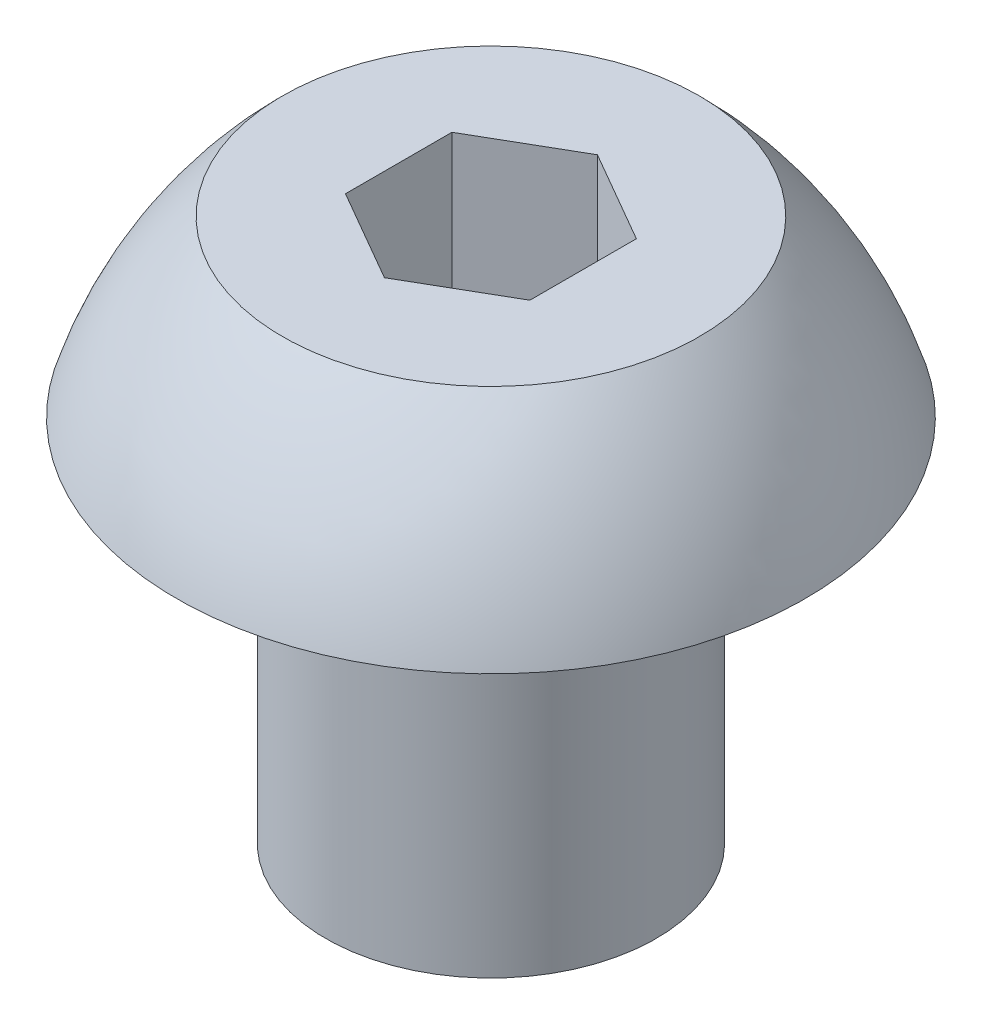
ISO-10303-21;
HEADER;
FILE_DESCRIPTION(('STEP AP214'),'2;1');
FILE_NAME('part.step','',(''),(''),'','','');
FILE_SCHEMA(('AUTOMOTIVE_DESIGN { 1 0 10303 214 1 1 1 1 }'));
ENDSEC;
DATA;
#1=APPLICATION_CONTEXT('core data for automotive mechanical design processes');
#2=APPLICATION_PROTOCOL_DEFINITION('international standard','automotive_design',2000,#1);
#3=PRODUCT_CONTEXT('',#1,'mechanical');
#4=PRODUCT('Part','Part','',(#3));
#5=PRODUCT_RELATED_PRODUCT_CATEGORY('part','',(#4));
#6=PRODUCT_DEFINITION_FORMATION('','',#4);
#7=PRODUCT_DEFINITION_CONTEXT('part definition',#1,'design');
#8=PRODUCT_DEFINITION('design','',#6,#7);
#9=PRODUCT_DEFINITION_SHAPE('','',#8);
#10=(LENGTH_UNIT() NAMED_UNIT(*) SI_UNIT(.MILLI.,.METRE.));
#11=(NAMED_UNIT(*) PLANE_ANGLE_UNIT() SI_UNIT($,.RADIAN.));
#12=(NAMED_UNIT(*) SI_UNIT($,.STERADIAN.) SOLID_ANGLE_UNIT());
#13=UNCERTAINTY_MEASURE_WITH_UNIT(LENGTH_MEASURE(1.E-05),#10,'distance_accuracy_value','');
#14=(GEOMETRIC_REPRESENTATION_CONTEXT(3) GLOBAL_UNCERTAINTY_ASSIGNED_CONTEXT((#13)) GLOBAL_UNIT_ASSIGNED_CONTEXT((#10,
#11,#12)) REPRESENTATION_CONTEXT('',''));
#15=CARTESIAN_POINT('',(0.,0.,0.));
#16=DIRECTION('',(0.,0.,1.));
#17=DIRECTION('',(1.,0.,0.));
#18=AXIS2_PLACEMENT_3D('',#15,#16,#17);
#19=CARTESIAN_POINT('',(0.,-3.175,0.));
#20=DIRECTION('',(0.,-1.,0.));
#21=DIRECTION('',(0.,0.,-1.));
#22=AXIS2_PLACEMENT_3D('',#19,#20,#21);
#23=CYLINDRICAL_SURFACE('',#22,1.4224);
#24=CARTESIAN_POINT('',(0.,-3.175,0.));
#25=DIRECTION('',(0.,-1.,0.));
#26=DIRECTION('',(0.,0.,-1.));
#27=AXIS2_PLACEMENT_3D('',#24,#25,#26);
#28=CIRCLE('',#27,1.4224);
#29=CARTESIAN_POINT('',(0.,-3.175,-1.4224));
#30=VERTEX_POINT('',#29);
#31=EDGE_CURVE('E134',#30,#30,#28,.T.);
#32=ORIENTED_EDGE('',*,*,#31,.F.);
#33=EDGE_LOOP('',(#32));
#34=FACE_BOUND('',#33,.T.);
#35=CARTESIAN_POINT('',(0.,0.,0.));
#36=DIRECTION('',(0.,-1.,0.));
#37=DIRECTION('',(0.,0.,-1.));
#38=AXIS2_PLACEMENT_3D('',#35,#36,#37);
#39=CIRCLE('',#38,1.4224);
#40=CARTESIAN_POINT('',(0.,0.,-1.4224));
#41=VERTEX_POINT('',#40);
#42=EDGE_CURVE('E11',#41,#41,#39,.T.);
#43=ORIENTED_EDGE('',*,*,#42,.T.);
#44=EDGE_LOOP('',(#43));
#45=FACE_BOUND('',#44,.T.);
#46=ADVANCED_FACE('F33',(#34,#45),#23,.T.);
#47=CARTESIAN_POINT('',(-1.4224,0.,0.));
#48=DIRECTION('',(0.,1.,0.));
#49=DIRECTION('',(0.,0.,1.));
#50=AXIS2_PLACEMENT_3D('',#47,#48,#49);
#51=PLANE('',#50);
#52=ORIENTED_EDGE('',*,*,#42,.F.);
#53=EDGE_LOOP('',(#52));
#54=FACE_BOUND('',#53,.T.);
#55=CARTESIAN_POINT('',(0.,0.,0.));
#56=DIRECTION('',(0.,-1.,0.));
#57=DIRECTION('',(0.,0.,-1.));
#58=AXIS2_PLACEMENT_3D('',#55,#56,#57);
#59=CIRCLE('',#58,2.7051);
#60=CARTESIAN_POINT('',(0.,0.,-2.7051));
#61=VERTEX_POINT('',#60);
#62=EDGE_CURVE('E40',#61,#61,#59,.T.);
#63=ORIENTED_EDGE('',*,*,#62,.T.);
#64=EDGE_LOOP('',(#63));
#65=FACE_BOUND('',#64,.T.);
#66=ADVANCED_FACE('F147',(#54,#65),#51,.F.);
#67=CARTESIAN_POINT('',(0.,-1.04271365415663,0.));
#68=DIRECTION('',(0.,-1.,0.));
#69=DIRECTION('',(0.,0.,-1.));
#70=AXIS2_PLACEMENT_3D('',#67,#68,#69);
#71=DEGENERATE_TOROIDAL_SURFACE('',#70,0.700107002516782,3.5612759643917,.F.);
#72=ORIENTED_EDGE('',*,*,#62,.F.);
#73=EDGE_LOOP('',(#72));
#74=FACE_BOUND('',#73,.T.);
#75=CARTESIAN_POINT('',(0.,1.4986,0.));
#76=DIRECTION('',(0.,-1.,0.));
#77=DIRECTION('',(0.,0.,-1.));
#78=AXIS2_PLACEMENT_3D('',#75,#76,#77);
#79=CIRCLE('',#78,1.7947700296736);
#80=CARTESIAN_POINT('',(0.,1.4986,-1.7947700296736));
#81=VERTEX_POINT('',#80);
#82=EDGE_CURVE('E142',#81,#81,#79,.T.);
#83=ORIENTED_EDGE('',*,*,#82,.T.);
#84=EDGE_LOOP('',(#83));
#85=FACE_BOUND('',#84,.T.);
#86=ADVANCED_FACE('F149',(#74,#85),#71,.F.);
#87=CARTESIAN_POINT('',(0.,1.4986,0.));
#88=DIRECTION('',(0.,-1.,0.));
#89=DIRECTION('',(0.,0.,-1.));
#90=AXIS2_PLACEMENT_3D('',#87,#88,#89);
#91=PLANE('',#90);
#92=DIRECTION('',(0.,0.,1.));
#93=VECTOR('',#92,1.);
#94=CARTESIAN_POINT('',(-0.79375,1.4986,-0.458271776169265));
#95=LINE('',#94,#93);
#96=CARTESIAN_POINT('',(-0.79375,1.4986,-0.458271776169265));
#97=VERTEX_POINT('',#96);
#98=CARTESIAN_POINT('',(-0.79375,1.4986,0.458271776169266));
#99=VERTEX_POINT('',#98);
#100=EDGE_CURVE('E121',#97,#99,#95,.T.);
#101=ORIENTED_EDGE('',*,*,#100,.F.);
#102=DIRECTION('',(-0.866025403784438,0.,0.5));
#103=VECTOR('',#102,1.);
#104=CARTESIAN_POINT('',(0.,1.4986,-0.916543552338531));
#105=LINE('',#104,#103);
#106=CARTESIAN_POINT('',(0.,1.4986,-0.916543552338531));
#107=VERTEX_POINT('',#106);
#108=EDGE_CURVE('E47',#107,#97,#105,.T.);
#109=ORIENTED_EDGE('',*,*,#108,.F.);
#110=DIRECTION('',(-0.866025403784439,0.,-0.5));
#111=VECTOR('',#110,1.);
#112=CARTESIAN_POINT('',(0.79375,1.4986,-0.458271776169266));
#113=LINE('',#112,#111);
#114=CARTESIAN_POINT('',(0.79375,1.4986,-0.458271776169266));
#115=VERTEX_POINT('',#114);
#116=EDGE_CURVE('E130',#115,#107,#113,.T.);
#117=ORIENTED_EDGE('',*,*,#116,.F.);
#118=DIRECTION('',(0.,0.,-1.));
#119=VECTOR('',#118,1.);
#120=CARTESIAN_POINT('',(0.79375,1.4986,0.458271776169265));
#121=LINE('',#120,#119);
#122=CARTESIAN_POINT('',(0.79375,1.4986,0.458271776169265));
#123=VERTEX_POINT('',#122);
#124=EDGE_CURVE('E128',#123,#115,#121,.T.);
#125=ORIENTED_EDGE('',*,*,#124,.F.);
#126=DIRECTION('',(0.866025403784439,0.,-0.5));
#127=VECTOR('',#126,1.);
#128=CARTESIAN_POINT('',(0.,1.4986,0.916543552338531));
#129=LINE('',#128,#127);
#130=CARTESIAN_POINT('',(0.,1.4986,0.916543552338531));
#131=VERTEX_POINT('',#130);
#132=EDGE_CURVE('E95',#131,#123,#129,.T.);
#133=ORIENTED_EDGE('',*,*,#132,.F.);
#134=DIRECTION('',(0.866025403784439,0.,0.5));
#135=VECTOR('',#134,1.);
#136=CARTESIAN_POINT('',(-0.79375,1.4986,0.458271776169266));
#137=LINE('',#136,#135);
#138=EDGE_CURVE('E124',#99,#131,#137,.T.);
#139=ORIENTED_EDGE('',*,*,#138,.F.);
#140=EDGE_LOOP('',(#101,#109,#117,#125,#133,#139));
#141=FACE_BOUND('',#140,.T.);
#142=ORIENTED_EDGE('',*,*,#82,.F.);
#143=EDGE_LOOP('',(#142));
#144=FACE_BOUND('',#143,.T.);
#145=ADVANCED_FACE('F152',(#141,#144),#91,.F.);
#146=CARTESIAN_POINT('',(-1.4224,-3.175,0.));
#147=DIRECTION('',(0.,1.,0.));
#148=DIRECTION('',(0.,0.,1.));
#149=AXIS2_PLACEMENT_3D('',#146,#147,#148);
#150=PLANE('',#149);
#151=ORIENTED_EDGE('',*,*,#31,.T.);
#152=EDGE_LOOP('',(#151));
#153=FACE_BOUND('',#152,.T.);
#154=ADVANCED_FACE('F157',(#153),#150,.F.);
#155=CARTESIAN_POINT('',(0.,0.2286,-0.916543552338531));
#156=DIRECTION('',(-0.5,0.,-0.866025403784438));
#157=DIRECTION('',(-0.866025403784439,0.,0.5));
#158=AXIS2_PLACEMENT_3D('',#155,#156,#157);
#159=PLANE('',#158);
#160=ORIENTED_EDGE('',*,*,#108,.T.);
#161=DIRECTION('',(0.,1.,0.));
#162=VECTOR('',#161,1.);
#163=CARTESIAN_POINT('',(-0.79375,0.2286,-0.458271776169265));
#164=LINE('',#163,#162);
#165=CARTESIAN_POINT('',(-0.79375,0.2286,-0.458271776169265));
#166=VERTEX_POINT('',#165);
#167=EDGE_CURVE('E77',#166,#97,#164,.T.);
#168=ORIENTED_EDGE('',*,*,#167,.F.);
#169=DIRECTION('',(-0.866025403784438,0.,0.5));
#170=VECTOR('',#169,1.);
#171=CARTESIAN_POINT('',(0.,0.2286,-0.916543552338531));
#172=LINE('',#171,#170);
#173=CARTESIAN_POINT('',(0.,0.2286,-0.916543552338531));
#174=VERTEX_POINT('',#173);
#175=EDGE_CURVE('E132',#174,#166,#172,.T.);
#176=ORIENTED_EDGE('',*,*,#175,.F.);
#177=DIRECTION('',(0.,1.,0.));
#178=VECTOR('',#177,1.);
#179=CARTESIAN_POINT('',(0.,0.2286,-0.916543552338531));
#180=LINE('',#179,#178);
#181=EDGE_CURVE('E55',#174,#107,#180,.T.);
#182=ORIENTED_EDGE('',*,*,#181,.T.);
#183=EDGE_LOOP('',(#160,#168,#176,#182));
#184=FACE_BOUND('',#183,.T.);
#185=ADVANCED_FACE('F163',(#184),#159,.F.);
#186=CARTESIAN_POINT('',(0.79375,0.2286,-0.458271776169266));
#187=DIRECTION('',(0.5,0.,-0.866025403784439));
#188=DIRECTION('',(-0.866025403784439,0.,-0.5));
#189=AXIS2_PLACEMENT_3D('',#186,#187,#188);
#190=PLANE('',#189);
#191=ORIENTED_EDGE('',*,*,#116,.T.);
#192=ORIENTED_EDGE('',*,*,#181,.F.);
#193=DIRECTION('',(-0.866025403784439,0.,-0.5));
#194=VECTOR('',#193,1.);
#195=CARTESIAN_POINT('',(0.79375,0.2286,-0.458271776169266));
#196=LINE('',#195,#194);
#197=CARTESIAN_POINT('',(0.79375,0.2286,-0.458271776169266));
#198=VERTEX_POINT('',#197);
#199=EDGE_CURVE('E107',#198,#174,#196,.T.);
#200=ORIENTED_EDGE('',*,*,#199,.F.);
#201=DIRECTION('',(0.,1.,0.));
#202=VECTOR('',#201,1.);
#203=CARTESIAN_POINT('',(0.79375,0.2286,-0.458271776169266));
#204=LINE('',#203,#202);
#205=EDGE_CURVE('E99',#198,#115,#204,.T.);
#206=ORIENTED_EDGE('',*,*,#205,.T.);
#207=EDGE_LOOP('',(#191,#192,#200,#206));
#208=FACE_BOUND('',#207,.T.);
#209=ADVANCED_FACE('F201',(#208),#190,.F.);
#210=CARTESIAN_POINT('',(0.79375,0.2286,0.458271776169265));
#211=DIRECTION('',(1.,0.,0.));
#212=DIRECTION('',(0.,0.,-1.));
#213=AXIS2_PLACEMENT_3D('',#210,#211,#212);
#214=PLANE('',#213);
#215=ORIENTED_EDGE('',*,*,#124,.T.);
#216=ORIENTED_EDGE('',*,*,#205,.F.);
#217=DIRECTION('',(0.,0.,-1.));
#218=VECTOR('',#217,1.);
#219=CARTESIAN_POINT('',(0.79375,0.2286,0.458271776169265));
#220=LINE('',#219,#218);
#221=CARTESIAN_POINT('',(0.79375,0.2286,0.458271776169265));
#222=VERTEX_POINT('',#221);
#223=EDGE_CURVE('E103',#222,#198,#220,.T.);
#224=ORIENTED_EDGE('',*,*,#223,.F.);
#225=DIRECTION('',(0.,1.,0.));
#226=VECTOR('',#225,1.);
#227=CARTESIAN_POINT('',(0.79375,0.2286,0.458271776169265));
#228=LINE('',#227,#226);
#229=EDGE_CURVE('E88',#222,#123,#228,.T.);
#230=ORIENTED_EDGE('',*,*,#229,.T.);
#231=EDGE_LOOP('',(#215,#216,#224,#230));
#232=FACE_BOUND('',#231,.T.);
#233=ADVANCED_FACE('F104',(#232),#214,.F.);
#234=CARTESIAN_POINT('',(0.,0.2286,0.916543552338531));
#235=DIRECTION('',(0.5,0.,0.866025403784439));
#236=DIRECTION('',(0.866025403784439,0.,-0.5));
#237=AXIS2_PLACEMENT_3D('',#234,#235,#236);
#238=PLANE('',#237);
#239=ORIENTED_EDGE('',*,*,#132,.T.);
#240=ORIENTED_EDGE('',*,*,#229,.F.);
#241=DIRECTION('',(0.866025403784439,0.,-0.5));
#242=VECTOR('',#241,1.);
#243=CARTESIAN_POINT('',(0.,0.2286,0.916543552338531));
#244=LINE('',#243,#242);
#245=CARTESIAN_POINT('',(0.,0.2286,0.916543552338531));
#246=VERTEX_POINT('',#245);
#247=EDGE_CURVE('E92',#246,#222,#244,.T.);
#248=ORIENTED_EDGE('',*,*,#247,.F.);
#249=DIRECTION('',(0.,1.,0.));
#250=VECTOR('',#249,1.);
#251=CARTESIAN_POINT('',(0.,0.2286,0.916543552338531));
#252=LINE('',#251,#250);
#253=EDGE_CURVE('E100',#246,#131,#252,.T.);
#254=ORIENTED_EDGE('',*,*,#253,.T.);
#255=EDGE_LOOP('',(#239,#240,#248,#254));
#256=FACE_BOUND('',#255,.T.);
#257=ADVANCED_FACE('F90',(#256),#238,.F.);
#258=CARTESIAN_POINT('',(-0.79375,0.2286,0.458271776169266));
#259=DIRECTION('',(-0.5,0.,0.866025403784439));
#260=DIRECTION('',(0.866025403784439,0.,0.5));
#261=AXIS2_PLACEMENT_3D('',#258,#259,#260);
#262=PLANE('',#261);
#263=ORIENTED_EDGE('',*,*,#138,.T.);
#264=ORIENTED_EDGE('',*,*,#253,.F.);
#265=DIRECTION('',(0.866025403784439,0.,0.5));
#266=VECTOR('',#265,1.);
#267=CARTESIAN_POINT('',(-0.79375,0.2286,0.458271776169266));
#268=LINE('',#267,#266);
#269=CARTESIAN_POINT('',(-0.79375,0.2286,0.458271776169266));
#270=VERTEX_POINT('',#269);
#271=EDGE_CURVE('E113',#270,#246,#268,.T.);
#272=ORIENTED_EDGE('',*,*,#271,.F.);
#273=DIRECTION('',(0.,1.,0.));
#274=VECTOR('',#273,1.);
#275=CARTESIAN_POINT('',(-0.79375,0.2286,0.458271776169266));
#276=LINE('',#275,#274);
#277=EDGE_CURVE('E137',#270,#99,#276,.T.);
#278=ORIENTED_EDGE('',*,*,#277,.T.);
#279=EDGE_LOOP('',(#263,#264,#272,#278));
#280=FACE_BOUND('',#279,.T.);
#281=ADVANCED_FACE('F226',(#280),#262,.F.);
#282=CARTESIAN_POINT('',(-0.79375,0.2286,-0.458271776169265));
#283=DIRECTION('',(-1.,0.,0.));
#284=DIRECTION('',(0.,0.,1.));
#285=AXIS2_PLACEMENT_3D('',#282,#283,#284);
#286=PLANE('',#285);
#287=ORIENTED_EDGE('',*,*,#100,.T.);
#288=ORIENTED_EDGE('',*,*,#277,.F.);
#289=DIRECTION('',(0.,0.,1.));
#290=VECTOR('',#289,1.);
#291=CARTESIAN_POINT('',(-0.79375,0.2286,-0.458271776169265));
#292=LINE('',#291,#290);
#293=EDGE_CURVE('E115',#166,#270,#292,.T.);
#294=ORIENTED_EDGE('',*,*,#293,.F.);
#295=ORIENTED_EDGE('',*,*,#167,.T.);
#296=EDGE_LOOP('',(#287,#288,#294,#295));
#297=FACE_BOUND('',#296,.T.);
#298=ADVANCED_FACE('F235',(#297),#286,.F.);
#299=CARTESIAN_POINT('',(0.,0.2286,0.));
#300=DIRECTION('',(0.,1.,0.));
#301=DIRECTION('',(0.,0.,1.));
#302=AXIS2_PLACEMENT_3D('',#299,#300,#301);
#303=PLANE('',#302);
#304=ORIENTED_EDGE('',*,*,#175,.T.);
#305=ORIENTED_EDGE('',*,*,#293,.T.);
#306=ORIENTED_EDGE('',*,*,#271,.T.);
#307=ORIENTED_EDGE('',*,*,#247,.T.);
#308=ORIENTED_EDGE('',*,*,#223,.T.);
#309=ORIENTED_EDGE('',*,*,#199,.T.);
#310=EDGE_LOOP('',(#304,#305,#306,#307,#308,#309));
#311=FACE_BOUND('',#310,.T.);
#312=ADVANCED_FACE('F110',(#311),#303,.T.);
#313=CLOSED_SHELL('',(#46,#66,#86,#145,#154,#185,#209,#233,#257,#281,#298,#312));
#314=MANIFOLD_SOLID_BREP('B2',#313);
#315=ADVANCED_BREP_SHAPE_REPRESENTATION('',(#18,#314),#14);
#316=SHAPE_DEFINITION_REPRESENTATION(#9,#315);
ENDSEC;
END-ISO-10303-21;
